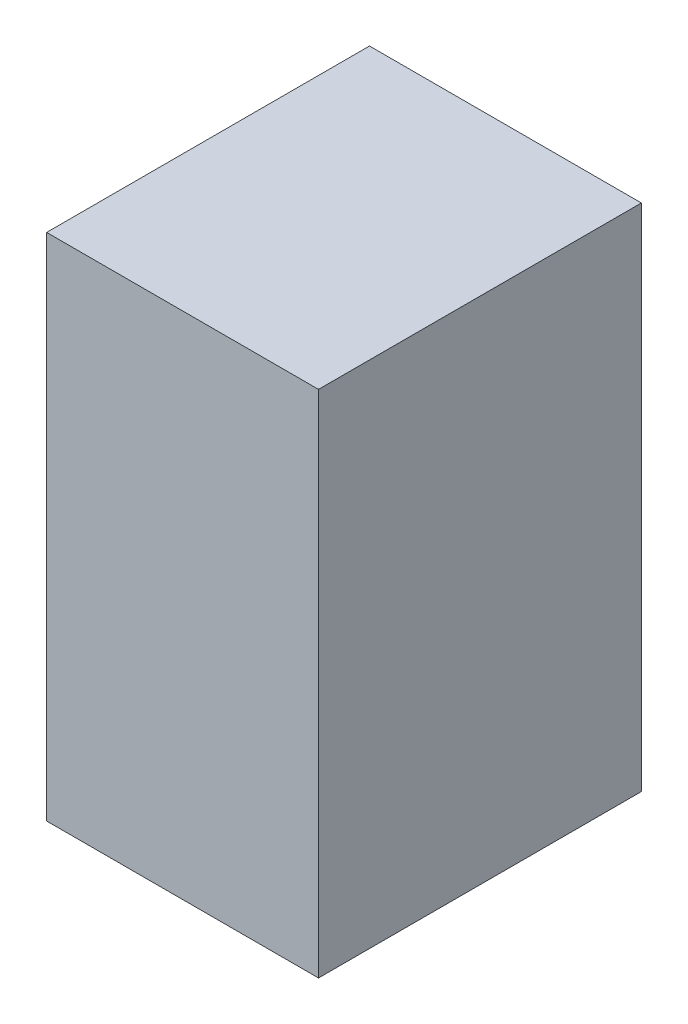
ISO-10303-21;
HEADER;
FILE_DESCRIPTION(('STEP AP214'),'2;1');
FILE_NAME('part.step','',(''),(''),'','','');
FILE_SCHEMA(('AUTOMOTIVE_DESIGN { 1 0 10303 214 1 1 1 1 }'));
ENDSEC;
DATA;
#1=APPLICATION_CONTEXT('core data for automotive mechanical design processes');
#2=APPLICATION_PROTOCOL_DEFINITION('international standard','automotive_design',2000,#1);
#3=PRODUCT_CONTEXT('',#1,'mechanical');
#4=PRODUCT('Part','Part','',(#3));
#5=PRODUCT_RELATED_PRODUCT_CATEGORY('part','',(#4));
#6=PRODUCT_DEFINITION_FORMATION('','',#4);
#7=PRODUCT_DEFINITION_CONTEXT('part definition',#1,'design');
#8=PRODUCT_DEFINITION('design','',#6,#7);
#9=PRODUCT_DEFINITION_SHAPE('','',#8);
#10=(LENGTH_UNIT() NAMED_UNIT(*) SI_UNIT(.MILLI.,.METRE.));
#11=(NAMED_UNIT(*) PLANE_ANGLE_UNIT() SI_UNIT($,.RADIAN.));
#12=(NAMED_UNIT(*) SI_UNIT($,.STERADIAN.) SOLID_ANGLE_UNIT());
#13=UNCERTAINTY_MEASURE_WITH_UNIT(LENGTH_MEASURE(1.E-05),#10,'distance_accuracy_value','');
#14=(GEOMETRIC_REPRESENTATION_CONTEXT(3) GLOBAL_UNCERTAINTY_ASSIGNED_CONTEXT((#13)) GLOBAL_UNIT_ASSIGNED_CONTEXT((#10,
#11,#12)) REPRESENTATION_CONTEXT('',''));
#15=CARTESIAN_POINT('',(0.,0.,0.));
#16=DIRECTION('',(0.,0.,1.));
#17=DIRECTION('',(1.,0.,0.));
#18=AXIS2_PLACEMENT_3D('',#15,#16,#17);
#19=CARTESIAN_POINT('',(0.2032,-0.381,0.));
#20=DIRECTION('',(-1.,0.,0.));
#21=DIRECTION('',(0.,0.,1.));
#22=AXIS2_PLACEMENT_3D('',#19,#20,#21);
#23=PLANE('',#22);
#24=DIRECTION('',(0.,0.,-1.));
#25=VECTOR('',#24,1.);
#26=CARTESIAN_POINT('',(0.2032,0.381,0.));
#27=LINE('',#26,#25);
#28=CARTESIAN_POINT('',(0.2032,0.381,0.));
#29=VERTEX_POINT('',#28);
#30=CARTESIAN_POINT('',(0.2032,0.381,0.4826));
#31=VERTEX_POINT('',#30);
#32=EDGE_CURVE('E20',#29,#31,#27,.F.);
#33=ORIENTED_EDGE('',*,*,#32,.T.);
#34=DIRECTION('',(0.,1.,0.));
#35=VECTOR('',#34,1.);
#36=CARTESIAN_POINT('',(0.2032,0.381,0.4826));
#37=LINE('',#36,#35);
#38=CARTESIAN_POINT('',(0.2032,-0.381,0.4826));
#39=VERTEX_POINT('',#38);
#40=EDGE_CURVE('E55',#31,#39,#37,.F.);
#41=ORIENTED_EDGE('',*,*,#40,.T.);
#42=DIRECTION('',(0.,0.,1.));
#43=VECTOR('',#42,1.);
#44=CARTESIAN_POINT('',(0.2032,-0.381,0.));
#45=LINE('',#44,#43);
#46=CARTESIAN_POINT('',(0.2032,-0.381,0.));
#47=VERTEX_POINT('',#46);
#48=EDGE_CURVE('E74',#39,#47,#45,.F.);
#49=ORIENTED_EDGE('',*,*,#48,.T.);
#50=DIRECTION('',(0.,1.,0.));
#51=VECTOR('',#50,1.);
#52=CARTESIAN_POINT('',(0.2032,0.381,0.));
#53=LINE('',#52,#51);
#54=EDGE_CURVE('E66',#29,#47,#53,.F.);
#55=ORIENTED_EDGE('',*,*,#54,.F.);
#56=EDGE_LOOP('',(#33,#41,#49,#55));
#57=FACE_BOUND('',#56,.T.);
#58=ADVANCED_FACE('F17',(#57),#23,.F.);
#59=CARTESIAN_POINT('',(0.2032,0.381,0.));
#60=DIRECTION('',(0.,-1.,0.));
#61=DIRECTION('',(0.,0.,-1.));
#62=AXIS2_PLACEMENT_3D('',#59,#60,#61);
#63=PLANE('',#62);
#64=DIRECTION('',(0.,0.,-1.));
#65=VECTOR('',#64,1.);
#66=CARTESIAN_POINT('',(-0.2032,0.381,0.));
#67=LINE('',#66,#65);
#68=CARTESIAN_POINT('',(-0.2032,0.381,0.));
#69=VERTEX_POINT('',#68);
#70=CARTESIAN_POINT('',(-0.2032,0.381,0.4826));
#71=VERTEX_POINT('',#70);
#72=EDGE_CURVE('E72',#69,#71,#67,.F.);
#73=ORIENTED_EDGE('',*,*,#72,.T.);
#74=DIRECTION('',(-1.,0.,0.));
#75=VECTOR('',#74,1.);
#76=CARTESIAN_POINT('',(0.2032,0.381,0.4826));
#77=LINE('',#76,#75);
#78=EDGE_CURVE('E62',#71,#31,#77,.F.);
#79=ORIENTED_EDGE('',*,*,#78,.T.);
#80=ORIENTED_EDGE('',*,*,#32,.F.);
#81=DIRECTION('',(-1.,0.,0.));
#82=VECTOR('',#81,1.);
#83=CARTESIAN_POINT('',(0.2032,0.381,0.));
#84=LINE('',#83,#82);
#85=EDGE_CURVE('E80',#69,#29,#84,.F.);
#86=ORIENTED_EDGE('',*,*,#85,.F.);
#87=EDGE_LOOP('',(#73,#79,#80,#86));
#88=FACE_BOUND('',#87,.T.);
#89=ADVANCED_FACE('F71',(#88),#63,.F.);
#90=CARTESIAN_POINT('',(0.2032,0.381,0.4826));
#91=DIRECTION('',(0.,0.,-1.));
#92=DIRECTION('',(-1.,0.,0.));
#93=AXIS2_PLACEMENT_3D('',#90,#91,#92);
#94=PLANE('',#93);
#95=DIRECTION('',(0.,1.,0.));
#96=VECTOR('',#95,1.);
#97=CARTESIAN_POINT('',(-0.2032,0.381,0.4826));
#98=LINE('',#97,#96);
#99=CARTESIAN_POINT('',(-0.2032,-0.381,0.4826));
#100=VERTEX_POINT('',#99);
#101=EDGE_CURVE('E83',#71,#100,#98,.F.);
#102=ORIENTED_EDGE('',*,*,#101,.T.);
#103=DIRECTION('',(1.,0.,0.));
#104=VECTOR('',#103,1.);
#105=CARTESIAN_POINT('',(-0.2032,-0.381,0.4826));
#106=LINE('',#105,#104);
#107=EDGE_CURVE('E64',#100,#39,#106,.T.);
#108=ORIENTED_EDGE('',*,*,#107,.T.);
#109=ORIENTED_EDGE('',*,*,#40,.F.);
#110=ORIENTED_EDGE('',*,*,#78,.F.);
#111=EDGE_LOOP('',(#102,#108,#109,#110));
#112=FACE_BOUND('',#111,.T.);
#113=ADVANCED_FACE('F60',(#112),#94,.F.);
#114=CARTESIAN_POINT('',(-0.2032,-0.381,0.));
#115=DIRECTION('',(0.,1.,0.));
#116=DIRECTION('',(0.,0.,1.));
#117=AXIS2_PLACEMENT_3D('',#114,#115,#116);
#118=PLANE('',#117);
#119=ORIENTED_EDGE('',*,*,#48,.F.);
#120=ORIENTED_EDGE('',*,*,#107,.F.);
#121=DIRECTION('',(0.,0.,-1.));
#122=VECTOR('',#121,1.);
#123=CARTESIAN_POINT('',(-0.2032,-0.381,0.));
#124=LINE('',#123,#122);
#125=CARTESIAN_POINT('',(-0.2032,-0.381,0.));
#126=VERTEX_POINT('',#125);
#127=EDGE_CURVE('E26',#100,#126,#124,.T.);
#128=ORIENTED_EDGE('',*,*,#127,.T.);
#129=DIRECTION('',(-1.,0.,0.));
#130=VECTOR('',#129,1.);
#131=CARTESIAN_POINT('',(0.2032,-0.381,0.));
#132=LINE('',#131,#130);
#133=EDGE_CURVE('E34',#47,#126,#132,.T.);
#134=ORIENTED_EDGE('',*,*,#133,.F.);
#135=EDGE_LOOP('',(#119,#120,#128,#134));
#136=FACE_BOUND('',#135,.T.);
#137=ADVANCED_FACE('F88',(#136),#118,.F.);
#138=CARTESIAN_POINT('',(0.2032,0.381,0.));
#139=DIRECTION('',(0.,0.,-1.));
#140=DIRECTION('',(-1.,0.,0.));
#141=AXIS2_PLACEMENT_3D('',#138,#139,#140);
#142=PLANE('',#141);
#143=DIRECTION('',(0.,1.,0.));
#144=VECTOR('',#143,1.);
#145=CARTESIAN_POINT('',(-0.2032,0.381,0.));
#146=LINE('',#145,#144);
#147=EDGE_CURVE('E11',#126,#69,#146,.T.);
#148=ORIENTED_EDGE('',*,*,#147,.T.);
#149=ORIENTED_EDGE('',*,*,#85,.T.);
#150=ORIENTED_EDGE('',*,*,#54,.T.);
#151=ORIENTED_EDGE('',*,*,#133,.T.);
#152=EDGE_LOOP('',(#148,#149,#150,#151));
#153=FACE_BOUND('',#152,.T.);
#154=ADVANCED_FACE('F91',(#153),#142,.T.);
#155=CARTESIAN_POINT('',(-0.2032,0.381,0.));
#156=DIRECTION('',(1.,0.,0.));
#157=DIRECTION('',(0.,0.,-1.));
#158=AXIS2_PLACEMENT_3D('',#155,#156,#157);
#159=PLANE('',#158);
#160=ORIENTED_EDGE('',*,*,#127,.F.);
#161=ORIENTED_EDGE('',*,*,#101,.F.);
#162=ORIENTED_EDGE('',*,*,#72,.F.);
#163=ORIENTED_EDGE('',*,*,#147,.F.);
#164=EDGE_LOOP('',(#160,#161,#162,#163));
#165=FACE_BOUND('',#164,.T.);
#166=ADVANCED_FACE('F90',(#165),#159,.F.);
#167=CLOSED_SHELL('',(#58,#89,#113,#137,#154,#166));
#168=MANIFOLD_SOLID_BREP('B1',#167);
#169=ADVANCED_BREP_SHAPE_REPRESENTATION('',(#18,#168),#14);
#170=SHAPE_DEFINITION_REPRESENTATION(#9,#169);
ENDSEC;
END-ISO-10303-21;
